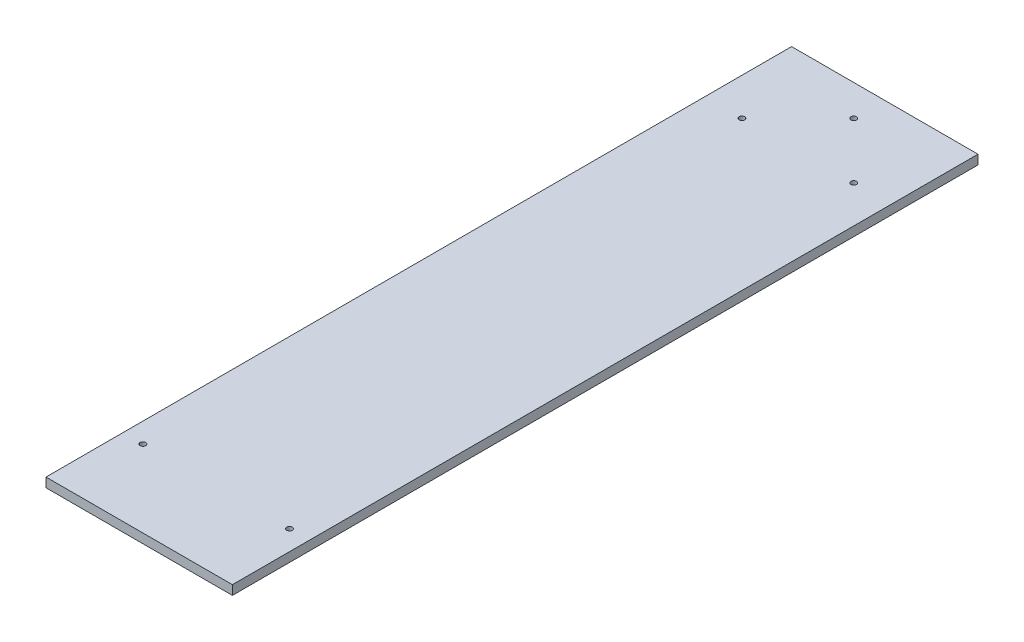
ISO-10303-21;
HEADER;
FILE_DESCRIPTION(('STEP AP214'),'2;1');
FILE_NAME('part.step','',(''),(''),'','','');
FILE_SCHEMA(('AUTOMOTIVE_DESIGN { 1 0 10303 214 1 1 1 1 }'));
ENDSEC;
DATA;
#1=APPLICATION_CONTEXT('core data for automotive mechanical design processes');
#2=APPLICATION_PROTOCOL_DEFINITION('international standard','automotive_design',2000,#1);
#3=PRODUCT_CONTEXT('',#1,'mechanical');
#4=PRODUCT('Part','Part','',(#3));
#5=PRODUCT_RELATED_PRODUCT_CATEGORY('part','',(#4));
#6=PRODUCT_DEFINITION_FORMATION('','',#4);
#7=PRODUCT_DEFINITION_CONTEXT('part definition',#1,'design');
#8=PRODUCT_DEFINITION('design','',#6,#7);
#9=PRODUCT_DEFINITION_SHAPE('','',#8);
#10=(LENGTH_UNIT() NAMED_UNIT(*) SI_UNIT(.MILLI.,.METRE.));
#11=(NAMED_UNIT(*) PLANE_ANGLE_UNIT() SI_UNIT($,.RADIAN.));
#12=(NAMED_UNIT(*) SI_UNIT($,.STERADIAN.) SOLID_ANGLE_UNIT());
#13=UNCERTAINTY_MEASURE_WITH_UNIT(LENGTH_MEASURE(1.E-05),#10,'distance_accuracy_value','');
#14=(GEOMETRIC_REPRESENTATION_CONTEXT(3) GLOBAL_UNCERTAINTY_ASSIGNED_CONTEXT((#13)) GLOBAL_UNIT_ASSIGNED_CONTEXT((#10,
#11,#12)) REPRESENTATION_CONTEXT('',''));
#15=CARTESIAN_POINT('',(0.,0.,0.));
#16=DIRECTION('',(0.,0.,1.));
#17=DIRECTION('',(1.,0.,0.));
#18=AXIS2_PLACEMENT_3D('',#15,#16,#17);
#19=CARTESIAN_POINT('',(150.,15.,-600.));
#20=DIRECTION('',(-1.,0.,0.));
#21=DIRECTION('',(0.,0.,1.));
#22=AXIS2_PLACEMENT_3D('',#19,#20,#21);
#23=PLANE('',#22);
#24=DIRECTION('',(0.,0.,-1.));
#25=VECTOR('',#24,1.);
#26=CARTESIAN_POINT('',(150.,0.,-600.));
#27=LINE('',#26,#25);
#28=CARTESIAN_POINT('',(150.,0.,600.));
#29=VERTEX_POINT('',#28);
#30=CARTESIAN_POINT('',(150.,0.,-600.));
#31=VERTEX_POINT('',#30);
#32=EDGE_CURVE('E96',#29,#31,#27,.T.);
#33=ORIENTED_EDGE('',*,*,#32,.T.);
#34=DIRECTION('',(0.,-1.,0.));
#35=VECTOR('',#34,1.);
#36=CARTESIAN_POINT('',(150.,15.,-600.));
#37=LINE('',#36,#35);
#38=CARTESIAN_POINT('',(150.,15.,-600.));
#39=VERTEX_POINT('',#38);
#40=EDGE_CURVE('E11',#39,#31,#37,.T.);
#41=ORIENTED_EDGE('',*,*,#40,.F.);
#42=DIRECTION('',(0.,0.,-1.));
#43=VECTOR('',#42,1.);
#44=CARTESIAN_POINT('',(150.,15.,-600.));
#45=LINE('',#44,#43);
#46=CARTESIAN_POINT('',(150.,15.,600.));
#47=VERTEX_POINT('',#46);
#48=EDGE_CURVE('E84',#47,#39,#45,.T.);
#49=ORIENTED_EDGE('',*,*,#48,.F.);
#50=DIRECTION('',(0.,-1.,0.));
#51=VECTOR('',#50,1.);
#52=CARTESIAN_POINT('',(150.,15.,600.));
#53=LINE('',#52,#51);
#54=EDGE_CURVE('E92',#47,#29,#53,.T.);
#55=ORIENTED_EDGE('',*,*,#54,.T.);
#56=EDGE_LOOP('',(#33,#41,#49,#55));
#57=FACE_BOUND('',#56,.T.);
#58=ADVANCED_FACE('F33',(#57),#23,.F.);
#59=CARTESIAN_POINT('',(-150.,15.,-600.));
#60=DIRECTION('',(0.,0.,1.));
#61=DIRECTION('',(1.,0.,0.));
#62=AXIS2_PLACEMENT_3D('',#59,#60,#61);
#63=PLANE('',#62);
#64=DIRECTION('',(-1.,0.,0.));
#65=VECTOR('',#64,1.);
#66=CARTESIAN_POINT('',(-150.,0.,-600.));
#67=LINE('',#66,#65);
#68=CARTESIAN_POINT('',(-150.,0.,-600.));
#69=VERTEX_POINT('',#68);
#70=EDGE_CURVE('E88',#31,#69,#67,.T.);
#71=ORIENTED_EDGE('',*,*,#70,.T.);
#72=DIRECTION('',(0.,-1.,0.));
#73=VECTOR('',#72,1.);
#74=CARTESIAN_POINT('',(-150.,15.,-600.));
#75=LINE('',#74,#73);
#76=CARTESIAN_POINT('',(-150.,15.,-600.));
#77=VERTEX_POINT('',#76);
#78=EDGE_CURVE('E41',#77,#69,#75,.T.);
#79=ORIENTED_EDGE('',*,*,#78,.F.);
#80=DIRECTION('',(-1.,0.,0.));
#81=VECTOR('',#80,1.);
#82=CARTESIAN_POINT('',(-150.,15.,-600.));
#83=LINE('',#82,#81);
#84=EDGE_CURVE('E79',#39,#77,#83,.T.);
#85=ORIENTED_EDGE('',*,*,#84,.F.);
#86=ORIENTED_EDGE('',*,*,#40,.T.);
#87=EDGE_LOOP('',(#71,#79,#85,#86));
#88=FACE_BOUND('',#87,.T.);
#89=ADVANCED_FACE('F87',(#88),#63,.F.);
#90=CARTESIAN_POINT('',(-150.,15.,-600.));
#91=DIRECTION('',(1.,0.,0.));
#92=DIRECTION('',(0.,0.,-1.));
#93=AXIS2_PLACEMENT_3D('',#90,#91,#92);
#94=PLANE('',#93);
#95=DIRECTION('',(0.,0.,1.));
#96=VECTOR('',#95,1.);
#97=CARTESIAN_POINT('',(-150.,0.,-600.));
#98=LINE('',#97,#96);
#99=CARTESIAN_POINT('',(-150.,0.,600.));
#100=VERTEX_POINT('',#99);
#101=EDGE_CURVE('E66',#69,#100,#98,.T.);
#102=ORIENTED_EDGE('',*,*,#101,.T.);
#103=DIRECTION('',(0.,-1.,0.));
#104=VECTOR('',#103,1.);
#105=CARTESIAN_POINT('',(-150.,15.,600.));
#106=LINE('',#105,#104);
#107=CARTESIAN_POINT('',(-150.,15.,600.));
#108=VERTEX_POINT('',#107);
#109=EDGE_CURVE('E89',#108,#100,#106,.T.);
#110=ORIENTED_EDGE('',*,*,#109,.F.);
#111=DIRECTION('',(0.,0.,1.));
#112=VECTOR('',#111,1.);
#113=CARTESIAN_POINT('',(-150.,15.,-600.));
#114=LINE('',#113,#112);
#115=EDGE_CURVE('E82',#77,#108,#114,.T.);
#116=ORIENTED_EDGE('',*,*,#115,.F.);
#117=ORIENTED_EDGE('',*,*,#78,.T.);
#118=EDGE_LOOP('',(#102,#110,#116,#117));
#119=FACE_BOUND('',#118,.T.);
#120=ADVANCED_FACE('F90',(#119),#94,.F.);
#121=CARTESIAN_POINT('',(-150.,15.,600.));
#122=DIRECTION('',(0.,0.,-1.));
#123=DIRECTION('',(-1.,0.,0.));
#124=AXIS2_PLACEMENT_3D('',#121,#122,#123);
#125=PLANE('',#124);
#126=DIRECTION('',(1.,0.,0.));
#127=VECTOR('',#126,1.);
#128=CARTESIAN_POINT('',(-150.,0.,600.));
#129=LINE('',#128,#127);
#130=EDGE_CURVE('E72',#100,#29,#129,.T.);
#131=ORIENTED_EDGE('',*,*,#130,.T.);
#132=ORIENTED_EDGE('',*,*,#54,.F.);
#133=DIRECTION('',(1.,0.,0.));
#134=VECTOR('',#133,1.);
#135=CARTESIAN_POINT('',(-150.,15.,600.));
#136=LINE('',#135,#134);
#137=EDGE_CURVE('E49',#108,#47,#136,.T.);
#138=ORIENTED_EDGE('',*,*,#137,.F.);
#139=ORIENTED_EDGE('',*,*,#109,.T.);
#140=EDGE_LOOP('',(#131,#132,#138,#139));
#141=FACE_BOUND('',#140,.T.);
#142=ADVANCED_FACE('F104',(#141),#125,.F.);
#143=CARTESIAN_POINT('',(0.,15.,0.));
#144=DIRECTION('',(0.,1.,0.));
#145=DIRECTION('',(0.,0.,1.));
#146=AXIS2_PLACEMENT_3D('',#143,#144,#145);
#147=PLANE('',#146);
#148=CARTESIAN_POINT('',(118.,15.,476.));
#149=DIRECTION('',(0.,1.,0.));
#150=DIRECTION('',(0.,0.,-1.));
#151=AXIS2_PLACEMENT_3D('',#148,#149,#150);
#152=CIRCLE('',#151,4.50000000000001);
#153=CARTESIAN_POINT('',(118.,15.,471.5));
#154=VERTEX_POINT('',#153);
#155=EDGE_CURVE('E116',#154,#154,#152,.T.);
#156=ORIENTED_EDGE('',*,*,#155,.F.);
#157=EDGE_LOOP('',(#156));
#158=FACE_BOUND('',#157,.T.);
#159=CARTESIAN_POINT('',(-118.,15.,476.));
#160=DIRECTION('',(0.,1.,0.));
#161=DIRECTION('',(0.,0.,1.));
#162=AXIS2_PLACEMENT_3D('',#159,#160,#161);
#163=CIRCLE('',#162,4.50000000000001);
#164=CARTESIAN_POINT('',(-118.,15.,480.5));
#165=VERTEX_POINT('',#164);
#166=EDGE_CURVE('E122',#165,#165,#163,.T.);
#167=ORIENTED_EDGE('',*,*,#166,.F.);
#168=EDGE_LOOP('',(#167));
#169=FACE_BOUND('',#168,.T.);
#170=CARTESIAN_POINT('',(0.,15.,-550.));
#171=DIRECTION('',(0.,1.,0.));
#172=DIRECTION('',(0.,0.,1.));
#173=AXIS2_PLACEMENT_3D('',#170,#171,#172);
#174=CIRCLE('',#173,4.5);
#175=CARTESIAN_POINT('',(0.,15.,-545.5));
#176=VERTEX_POINT('',#175);
#177=EDGE_CURVE('E128',#176,#176,#174,.T.);
#178=ORIENTED_EDGE('',*,*,#177,.F.);
#179=EDGE_LOOP('',(#178));
#180=FACE_BOUND('',#179,.T.);
#181=CARTESIAN_POINT('',(90.,15.,-460.));
#182=DIRECTION('',(0.,1.,0.));
#183=DIRECTION('',(0.,0.,-1.));
#184=AXIS2_PLACEMENT_3D('',#181,#182,#183);
#185=CIRCLE('',#184,4.50000000000001);
#186=CARTESIAN_POINT('',(90.,15.,-464.5));
#187=VERTEX_POINT('',#186);
#188=EDGE_CURVE('E134',#187,#187,#185,.T.);
#189=ORIENTED_EDGE('',*,*,#188,.F.);
#190=EDGE_LOOP('',(#189));
#191=FACE_BOUND('',#190,.T.);
#192=CARTESIAN_POINT('',(-90.,15.,-460.));
#193=DIRECTION('',(0.,1.,0.));
#194=DIRECTION('',(0.,0.,1.));
#195=AXIS2_PLACEMENT_3D('',#192,#193,#194);
#196=CIRCLE('',#195,4.50000000000001);
#197=CARTESIAN_POINT('',(-90.,15.,-455.5));
#198=VERTEX_POINT('',#197);
#199=EDGE_CURVE('E110',#198,#198,#196,.T.);
#200=ORIENTED_EDGE('',*,*,#199,.F.);
#201=EDGE_LOOP('',(#200));
#202=FACE_BOUND('',#201,.T.);
#203=ORIENTED_EDGE('',*,*,#48,.T.);
#204=ORIENTED_EDGE('',*,*,#84,.T.);
#205=ORIENTED_EDGE('',*,*,#115,.T.);
#206=ORIENTED_EDGE('',*,*,#137,.T.);
#207=EDGE_LOOP('',(#203,#204,#205,#206));
#208=FACE_BOUND('',#207,.T.);
#209=ADVANCED_FACE('F80',(#158,#169,#180,#191,#202,#208),#147,.T.);
#210=CARTESIAN_POINT('',(0.,0.,0.));
#211=DIRECTION('',(0.,1.,0.));
#212=DIRECTION('',(0.,0.,1.));
#213=AXIS2_PLACEMENT_3D('',#210,#211,#212);
#214=PLANE('',#213);
#215=CARTESIAN_POINT('',(118.,0.,476.));
#216=DIRECTION('',(0.,1.,0.));
#217=DIRECTION('',(0.,0.,-1.));
#218=AXIS2_PLACEMENT_3D('',#215,#216,#217);
#219=CIRCLE('',#218,4.50000000000001);
#220=CARTESIAN_POINT('',(118.,0.,471.5));
#221=VERTEX_POINT('',#220);
#222=EDGE_CURVE('E119',#221,#221,#219,.T.);
#223=ORIENTED_EDGE('',*,*,#222,.T.);
#224=EDGE_LOOP('',(#223));
#225=FACE_BOUND('',#224,.T.);
#226=CARTESIAN_POINT('',(-118.,0.,476.));
#227=DIRECTION('',(0.,1.,0.));
#228=DIRECTION('',(0.,0.,1.));
#229=AXIS2_PLACEMENT_3D('',#226,#227,#228);
#230=CIRCLE('',#229,4.50000000000001);
#231=CARTESIAN_POINT('',(-118.,0.,480.5));
#232=VERTEX_POINT('',#231);
#233=EDGE_CURVE('E125',#232,#232,#230,.T.);
#234=ORIENTED_EDGE('',*,*,#233,.T.);
#235=EDGE_LOOP('',(#234));
#236=FACE_BOUND('',#235,.T.);
#237=CARTESIAN_POINT('',(0.,0.,-550.));
#238=DIRECTION('',(0.,1.,0.));
#239=DIRECTION('',(0.,0.,1.));
#240=AXIS2_PLACEMENT_3D('',#237,#238,#239);
#241=CIRCLE('',#240,4.5);
#242=CARTESIAN_POINT('',(0.,0.,-545.5));
#243=VERTEX_POINT('',#242);
#244=EDGE_CURVE('E131',#243,#243,#241,.T.);
#245=ORIENTED_EDGE('',*,*,#244,.T.);
#246=EDGE_LOOP('',(#245));
#247=FACE_BOUND('',#246,.T.);
#248=CARTESIAN_POINT('',(90.,0.,-460.));
#249=DIRECTION('',(0.,1.,0.));
#250=DIRECTION('',(0.,0.,-1.));
#251=AXIS2_PLACEMENT_3D('',#248,#249,#250);
#252=CIRCLE('',#251,4.50000000000001);
#253=CARTESIAN_POINT('',(90.,0.,-464.5));
#254=VERTEX_POINT('',#253);
#255=EDGE_CURVE('E113',#254,#254,#252,.T.);
#256=ORIENTED_EDGE('',*,*,#255,.T.);
#257=EDGE_LOOP('',(#256));
#258=FACE_BOUND('',#257,.T.);
#259=CARTESIAN_POINT('',(-90.,0.,-460.));
#260=DIRECTION('',(0.,1.,0.));
#261=DIRECTION('',(0.,0.,1.));
#262=AXIS2_PLACEMENT_3D('',#259,#260,#261);
#263=CIRCLE('',#262,4.50000000000001);
#264=CARTESIAN_POINT('',(-90.,0.,-455.5));
#265=VERTEX_POINT('',#264);
#266=EDGE_CURVE('E99',#265,#265,#263,.T.);
#267=ORIENTED_EDGE('',*,*,#266,.T.);
#268=EDGE_LOOP('',(#267));
#269=FACE_BOUND('',#268,.T.);
#270=ORIENTED_EDGE('',*,*,#32,.F.);
#271=ORIENTED_EDGE('',*,*,#130,.F.);
#272=ORIENTED_EDGE('',*,*,#101,.F.);
#273=ORIENTED_EDGE('',*,*,#70,.F.);
#274=EDGE_LOOP('',(#270,#271,#272,#273));
#275=FACE_BOUND('',#274,.T.);
#276=ADVANCED_FACE('F107',(#225,#236,#247,#258,#269,#275),#214,.F.);
#277=CARTESIAN_POINT('',(-90.,0.,-460.));
#278=DIRECTION('',(0.,1.,0.));
#279=DIRECTION('',(0.,0.,1.));
#280=AXIS2_PLACEMENT_3D('',#277,#278,#279);
#281=CYLINDRICAL_SURFACE('',#280,4.50000000000001);
#282=ORIENTED_EDGE('',*,*,#266,.F.);
#283=EDGE_LOOP('',(#282));
#284=FACE_BOUND('',#283,.T.);
#285=ORIENTED_EDGE('',*,*,#199,.T.);
#286=EDGE_LOOP('',(#285));
#287=FACE_BOUND('',#286,.T.);
#288=ADVANCED_FACE('F146',(#284,#287),#281,.F.);
#289=CARTESIAN_POINT('',(90.,0.,-460.));
#290=DIRECTION('',(0.,1.,0.));
#291=DIRECTION('',(0.,0.,1.));
#292=AXIS2_PLACEMENT_3D('',#289,#290,#291);
#293=CYLINDRICAL_SURFACE('',#292,4.50000000000001);
#294=ORIENTED_EDGE('',*,*,#255,.F.);
#295=EDGE_LOOP('',(#294));
#296=FACE_BOUND('',#295,.T.);
#297=ORIENTED_EDGE('',*,*,#188,.T.);
#298=EDGE_LOOP('',(#297));
#299=FACE_BOUND('',#298,.T.);
#300=ADVANCED_FACE('F142',(#296,#299),#293,.F.);
#301=CARTESIAN_POINT('',(0.,0.,-550.));
#302=DIRECTION('',(0.,1.,0.));
#303=DIRECTION('',(0.,0.,1.));
#304=AXIS2_PLACEMENT_3D('',#301,#302,#303);
#305=CYLINDRICAL_SURFACE('',#304,4.5);
#306=ORIENTED_EDGE('',*,*,#244,.F.);
#307=EDGE_LOOP('',(#306));
#308=FACE_BOUND('',#307,.T.);
#309=ORIENTED_EDGE('',*,*,#177,.T.);
#310=EDGE_LOOP('',(#309));
#311=FACE_BOUND('',#310,.T.);
#312=ADVANCED_FACE('F145',(#308,#311),#305,.F.);
#313=CARTESIAN_POINT('',(-118.,0.,476.));
#314=DIRECTION('',(0.,1.,0.));
#315=DIRECTION('',(0.,0.,1.));
#316=AXIS2_PLACEMENT_3D('',#313,#314,#315);
#317=CYLINDRICAL_SURFACE('',#316,4.50000000000001);
#318=ORIENTED_EDGE('',*,*,#233,.F.);
#319=EDGE_LOOP('',(#318));
#320=FACE_BOUND('',#319,.T.);
#321=ORIENTED_EDGE('',*,*,#166,.T.);
#322=EDGE_LOOP('',(#321));
#323=FACE_BOUND('',#322,.T.);
#324=ADVANCED_FACE('F207',(#320,#323),#317,.F.);
#325=CARTESIAN_POINT('',(118.,0.,476.));
#326=DIRECTION('',(0.,1.,0.));
#327=DIRECTION('',(0.,0.,1.));
#328=AXIS2_PLACEMENT_3D('',#325,#326,#327);
#329=CYLINDRICAL_SURFACE('',#328,4.50000000000001);
#330=ORIENTED_EDGE('',*,*,#222,.F.);
#331=EDGE_LOOP('',(#330));
#332=FACE_BOUND('',#331,.T.);
#333=ORIENTED_EDGE('',*,*,#155,.T.);
#334=EDGE_LOOP('',(#333));
#335=FACE_BOUND('',#334,.T.);
#336=ADVANCED_FACE('F217',(#332,#335),#329,.F.);
#337=CLOSED_SHELL('',(#58,#89,#120,#142,#209,#276,#288,#300,#312,#324,#336));
#338=MANIFOLD_SOLID_BREP('B2',#337);
#339=ADVANCED_BREP_SHAPE_REPRESENTATION('',(#18,#338),#14);
#340=SHAPE_DEFINITION_REPRESENTATION(#9,#339);
ENDSEC;
END-ISO-10303-21;
